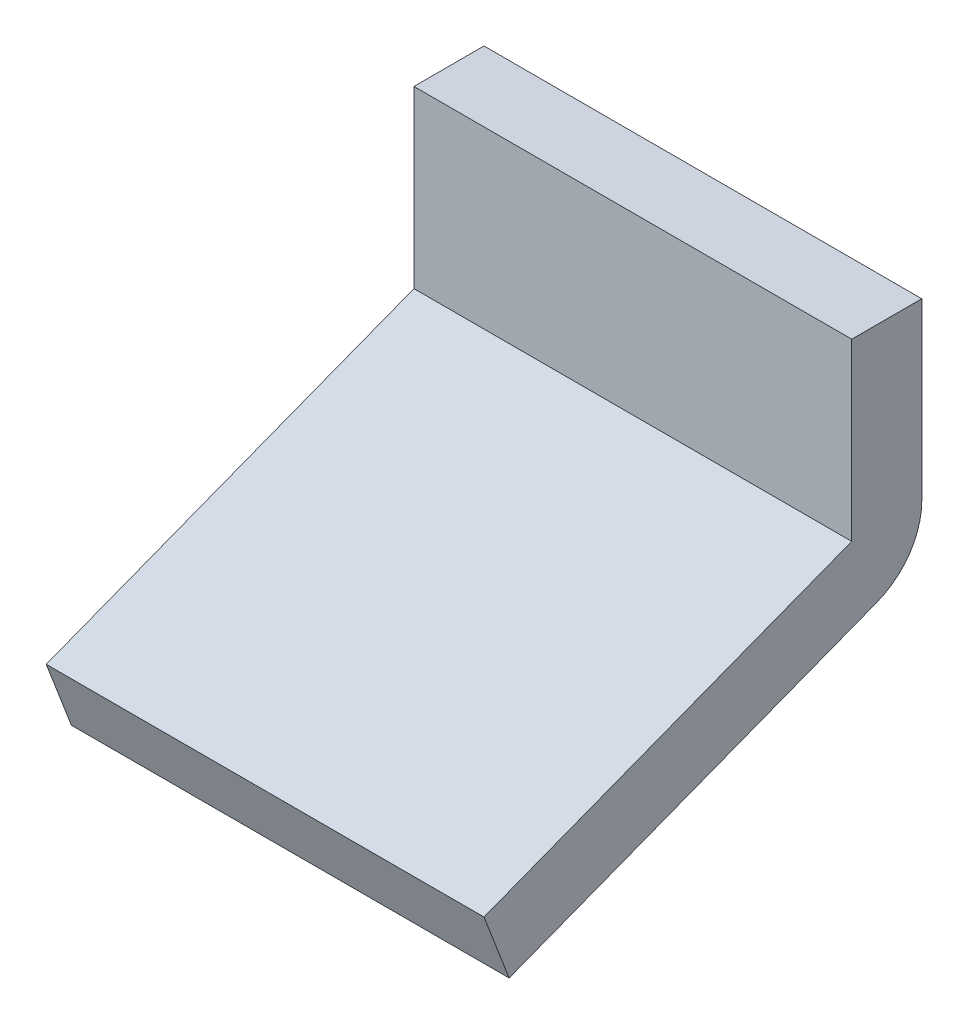
ISO-10303-21;
HEADER;
FILE_DESCRIPTION(('STEP AP214'),'2;1');
FILE_NAME('part.step','',(''),(''),'','','');
FILE_SCHEMA(('AUTOMOTIVE_DESIGN { 1 0 10303 214 1 1 1 1 }'));
ENDSEC;
DATA;
#1=APPLICATION_CONTEXT('core data for automotive mechanical design processes');
#2=APPLICATION_PROTOCOL_DEFINITION('international standard','automotive_design',2000,#1);
#3=PRODUCT_CONTEXT('',#1,'mechanical');
#4=PRODUCT('Part','Part','',(#3));
#5=PRODUCT_RELATED_PRODUCT_CATEGORY('part','',(#4));
#6=PRODUCT_DEFINITION_FORMATION('','',#4);
#7=PRODUCT_DEFINITION_CONTEXT('part definition',#1,'design');
#8=PRODUCT_DEFINITION('design','',#6,#7);
#9=PRODUCT_DEFINITION_SHAPE('','',#8);
#10=(LENGTH_UNIT() NAMED_UNIT(*) SI_UNIT(.MILLI.,.METRE.));
#11=(NAMED_UNIT(*) PLANE_ANGLE_UNIT() SI_UNIT($,.RADIAN.));
#12=(NAMED_UNIT(*) SI_UNIT($,.STERADIAN.) SOLID_ANGLE_UNIT());
#13=UNCERTAINTY_MEASURE_WITH_UNIT(LENGTH_MEASURE(1.E-05),#10,'distance_accuracy_value','');
#14=(GEOMETRIC_REPRESENTATION_CONTEXT(3) GLOBAL_UNCERTAINTY_ASSIGNED_CONTEXT((#13)) GLOBAL_UNIT_ASSIGNED_CONTEXT((#10,
#11,#12)) REPRESENTATION_CONTEXT('',''));
#15=CARTESIAN_POINT('',(0.,0.,0.));
#16=DIRECTION('',(0.,0.,1.));
#17=DIRECTION('',(1.,0.,0.));
#18=AXIS2_PLACEMENT_3D('',#15,#16,#17);
#19=CARTESIAN_POINT('',(-1.6,-2.25,0.0800000000000071));
#20=DIRECTION('',(0.,0.,-1.));
#21=DIRECTION('',(-1.,0.,0.));
#22=AXIS2_PLACEMENT_3D('',#19,#20,#21);
#23=PLANE('',#22);
#24=DIRECTION('',(0.,1.,0.));
#25=VECTOR('',#24,1.);
#26=CARTESIAN_POINT('',(1.1,-2.19208273518227,0.0800000000000071));
#27=LINE('',#26,#25);
#28=CARTESIAN_POINT('',(1.1,-2.25,0.0800000000000071));
#29=VERTEX_POINT('',#28);
#30=CARTESIAN_POINT('',(1.1,-2.45,0.0800000000000071));
#31=VERTEX_POINT('',#30);
#32=EDGE_CURVE('E123',#29,#31,#27,.F.);
#33=ORIENTED_EDGE('',*,*,#32,.T.);
#34=DIRECTION('',(1.,0.,0.));
#35=VECTOR('',#34,1.);
#36=CARTESIAN_POINT('',(1.6,-2.45,0.0800000000000071));
#37=LINE('',#36,#35);
#38=CARTESIAN_POINT('',(1.6,-2.45,0.0800000000000071));
#39=VERTEX_POINT('',#38);
#40=EDGE_CURVE('E108',#39,#31,#37,.F.);
#41=ORIENTED_EDGE('',*,*,#40,.F.);
#42=DIRECTION('',(0.,1.,0.));
#43=VECTOR('',#42,1.);
#44=CARTESIAN_POINT('',(1.6,-2.45,0.0800000000000071));
#45=LINE('',#44,#43);
#46=CARTESIAN_POINT('',(1.6,-2.25,0.0800000000000071));
#47=VERTEX_POINT('',#46);
#48=EDGE_CURVE('E131',#39,#47,#45,.T.);
#49=ORIENTED_EDGE('',*,*,#48,.T.);
#50=DIRECTION('',(1.,0.,0.));
#51=VECTOR('',#50,1.);
#52=CARTESIAN_POINT('',(-1.6,-2.25,0.0800000000000071));
#53=LINE('',#52,#51);
#54=EDGE_CURVE('E139',#47,#29,#53,.F.);
#55=ORIENTED_EDGE('',*,*,#54,.T.);
#56=EDGE_LOOP('',(#33,#41,#49,#55));
#57=FACE_BOUND('',#56,.T.);
#58=ADVANCED_FACE('F16',(#57),#23,.F.);
#59=CARTESIAN_POINT('',(-1.6,-2.25,0.));
#60=DIRECTION('',(0.,-1.,0.));
#61=DIRECTION('',(0.,0.,-1.));
#62=AXIS2_PLACEMENT_3D('',#59,#60,#61);
#63=PLANE('',#62);
#64=DIRECTION('',(0.,0.,-1.));
#65=VECTOR('',#64,1.);
#66=CARTESIAN_POINT('',(1.1,-2.25,0.0222781440158591));
#67=LINE('',#66,#65);
#68=CARTESIAN_POINT('',(1.1,-2.25,0.));
#69=VERTEX_POINT('',#68);
#70=EDGE_CURVE('E107',#69,#29,#67,.F.);
#71=ORIENTED_EDGE('',*,*,#70,.T.);
#72=ORIENTED_EDGE('',*,*,#54,.F.);
#73=DIRECTION('',(0.,0.,1.));
#74=VECTOR('',#73,1.);
#75=CARTESIAN_POINT('',(1.6,-2.25,0.0800000000000071));
#76=LINE('',#75,#74);
#77=CARTESIAN_POINT('',(1.6,-2.25,0.));
#78=VERTEX_POINT('',#77);
#79=EDGE_CURVE('E133',#47,#78,#76,.F.);
#80=ORIENTED_EDGE('',*,*,#79,.T.);
#81=DIRECTION('',(-1.,0.,0.));
#82=VECTOR('',#81,1.);
#83=CARTESIAN_POINT('',(-1.6,-2.25,0.));
#84=LINE('',#83,#82);
#85=EDGE_CURVE('E128',#69,#78,#84,.F.);
#86=ORIENTED_EDGE('',*,*,#85,.F.);
#87=EDGE_LOOP('',(#71,#72,#80,#86));
#88=FACE_BOUND('',#87,.T.);
#89=ADVANCED_FACE('F173',(#88),#63,.F.);
#90=CARTESIAN_POINT('',(-1.6,-2.25,0.));
#91=DIRECTION('',(0.,0.,-1.));
#92=DIRECTION('',(-1.,0.,0.));
#93=AXIS2_PLACEMENT_3D('',#90,#91,#92);
#94=PLANE('',#93);
#95=DIRECTION('',(0.,1.,0.));
#96=VECTOR('',#95,1.);
#97=CARTESIAN_POINT('',(1.6,-2.45,0.));
#98=LINE('',#97,#96);
#99=CARTESIAN_POINT('',(1.6,-2.45,0.));
#100=VERTEX_POINT('',#99);
#101=EDGE_CURVE('E143',#78,#100,#98,.F.);
#102=ORIENTED_EDGE('',*,*,#101,.T.);
#103=DIRECTION('',(1.,0.,0.));
#104=VECTOR('',#103,1.);
#105=CARTESIAN_POINT('',(1.6,-2.45,0.));
#106=LINE('',#105,#104);
#107=CARTESIAN_POINT('',(1.1,-2.45,0.));
#108=VERTEX_POINT('',#107);
#109=EDGE_CURVE('E85',#108,#100,#106,.T.);
#110=ORIENTED_EDGE('',*,*,#109,.F.);
#111=DIRECTION('',(0.,1.,0.));
#112=VECTOR('',#111,1.);
#113=CARTESIAN_POINT('',(1.1,-2.19208273518227,0.));
#114=LINE('',#113,#112);
#115=EDGE_CURVE('E81',#108,#69,#114,.T.);
#116=ORIENTED_EDGE('',*,*,#115,.T.);
#117=ORIENTED_EDGE('',*,*,#85,.T.);
#118=EDGE_LOOP('',(#102,#110,#116,#117));
#119=FACE_BOUND('',#118,.T.);
#120=ADVANCED_FACE('F174',(#119),#94,.T.);
#121=CARTESIAN_POINT('',(1.6,-2.45,0.0800000000000071));
#122=DIRECTION('',(0.,0.933333333333333,0.359010987142301));
#123=DIRECTION('',(0.,-0.359010987142301,0.933333333333333));
#124=AXIS2_PLACEMENT_3D('',#121,#122,#123);
#125=PLANE('',#124);
#126=DIRECTION('',(0.,0.35901098714229,-0.933333333333337));
#127=VECTOR('',#126,1.);
#128=CARTESIAN_POINT('',(1.6,-2.61155494421403,0.500000000000007));
#129=LINE('',#128,#127);
#130=CARTESIAN_POINT('',(1.6,-2.61155494421403,0.500000000000007));
#131=VERTEX_POINT('',#130);
#132=EDGE_CURVE('E113',#131,#39,#129,.T.);
#133=ORIENTED_EDGE('',*,*,#132,.T.);
#134=ORIENTED_EDGE('',*,*,#40,.T.);
#135=DIRECTION('',(0.,-0.35901098714229,0.933333333333337));
#136=VECTOR('',#135,1.);
#137=CARTESIAN_POINT('',(1.1,-2.45,0.0800000000000071));
#138=LINE('',#137,#136);
#139=CARTESIAN_POINT('',(1.1,-2.61155494421403,0.500000000000007));
#140=VERTEX_POINT('',#139);
#141=EDGE_CURVE('E86',#31,#140,#138,.T.);
#142=ORIENTED_EDGE('',*,*,#141,.T.);
#143=DIRECTION('',(1.,0.,0.));
#144=VECTOR('',#143,1.);
#145=CARTESIAN_POINT('',(1.6,-2.61155494421403,0.500000000000007));
#146=LINE('',#145,#144);
#147=EDGE_CURVE('E96',#131,#140,#146,.F.);
#148=ORIENTED_EDGE('',*,*,#147,.F.);
#149=EDGE_LOOP('',(#133,#134,#142,#148));
#150=FACE_BOUND('',#149,.T.);
#151=ADVANCED_FACE('F178',(#150),#125,.T.);
#152=CARTESIAN_POINT('',(1.1,-2.19208273518227,0.0222781440158591));
#153=DIRECTION('',(1.,0.,0.));
#154=DIRECTION('',(0.,0.,-1.));
#155=AXIS2_PLACEMENT_3D('',#152,#153,#154);
#156=PLANE('',#155);
#157=ORIENTED_EDGE('',*,*,#32,.F.);
#158=ORIENTED_EDGE('',*,*,#70,.F.);
#159=ORIENTED_EDGE('',*,*,#115,.F.);
#160=CARTESIAN_POINT('',(1.1,-2.45,0.0800000000000071));
#161=DIRECTION('',(1.,0.,0.));
#162=DIRECTION('',(0.,0.,-1.));
#163=AXIS2_PLACEMENT_3D('',#160,#161,#162);
#164=CIRCLE('',#163,0.0800000000000036);
#165=CARTESIAN_POINT('',(1.1,-2.52466666666667,0.0512791210286231));
#166=VERTEX_POINT('',#165);
#167=EDGE_CURVE('E19',#166,#108,#164,.T.);
#168=ORIENTED_EDGE('',*,*,#167,.F.);
#169=DIRECTION('',(0.,0.359010987142294,-0.933333333333336));
#170=VECTOR('',#169,1.);
#171=CARTESIAN_POINT('',(1.1,-2.6862216108807,0.471279121028623));
#172=LINE('',#171,#170);
#173=CARTESIAN_POINT('',(1.1,-2.6862216108807,0.471279121028622));
#174=VERTEX_POINT('',#173);
#175=EDGE_CURVE('E77',#174,#166,#172,.T.);
#176=ORIENTED_EDGE('',*,*,#175,.F.);
#177=DIRECTION('',(0.,-0.933333333333333,-0.359010987142301));
#178=VECTOR('',#177,1.);
#179=CARTESIAN_POINT('',(1.1,-2.61155494421403,0.500000000000007));
#180=LINE('',#179,#178);
#181=EDGE_CURVE('E111',#140,#174,#180,.T.);
#182=ORIENTED_EDGE('',*,*,#181,.F.);
#183=ORIENTED_EDGE('',*,*,#141,.F.);
#184=EDGE_LOOP('',(#157,#158,#159,#168,#176,#182,#183));
#185=FACE_BOUND('',#184,.T.);
#186=ADVANCED_FACE('F74',(#185),#156,.F.);
#187=CARTESIAN_POINT('',(1.6,-2.45,0.0800000000000071));
#188=DIRECTION('',(1.,0.,0.));
#189=DIRECTION('',(0.,0.,-1.));
#190=AXIS2_PLACEMENT_3D('',#187,#188,#189);
#191=CYLINDRICAL_SURFACE('',#190,0.0800000000000036);
#192=CARTESIAN_POINT('',(1.6,-2.45,0.0800000000000071));
#193=DIRECTION('',(1.,0.,0.));
#194=DIRECTION('',(0.,0.,-1.));
#195=AXIS2_PLACEMENT_3D('',#192,#193,#194);
#196=CIRCLE('',#195,0.0800000000000036);
#197=CARTESIAN_POINT('',(1.6,-2.52466666666667,0.0512791210286231));
#198=VERTEX_POINT('',#197);
#199=EDGE_CURVE('E91',#100,#198,#196,.F.);
#200=ORIENTED_EDGE('',*,*,#199,.T.);
#201=DIRECTION('',(1.,0.,0.));
#202=VECTOR('',#201,1.);
#203=CARTESIAN_POINT('',(1.6,-2.52466666666667,0.051279121028623));
#204=LINE('',#203,#202);
#205=EDGE_CURVE('E88',#166,#198,#204,.T.);
#206=ORIENTED_EDGE('',*,*,#205,.F.);
#207=ORIENTED_EDGE('',*,*,#167,.T.);
#208=ORIENTED_EDGE('',*,*,#109,.T.);
#209=EDGE_LOOP('',(#200,#206,#207,#208));
#210=FACE_BOUND('',#209,.T.);
#211=ADVANCED_FACE('F89',(#210),#191,.T.);
#212=CARTESIAN_POINT('',(1.6,-2.45,0.0800000000000071));
#213=DIRECTION('',(-1.,0.,0.));
#214=DIRECTION('',(0.,0.,1.));
#215=AXIS2_PLACEMENT_3D('',#212,#213,#214);
#216=PLANE('',#215);
#217=DIRECTION('',(0.,-0.933333333333333,-0.359010987142301));
#218=VECTOR('',#217,1.);
#219=CARTESIAN_POINT('',(1.6,-2.61155494421403,0.500000000000007));
#220=LINE('',#219,#218);
#221=CARTESIAN_POINT('',(1.6,-2.6862216108807,0.471279121028622));
#222=VERTEX_POINT('',#221);
#223=EDGE_CURVE('E34',#222,#131,#220,.F.);
#224=ORIENTED_EDGE('',*,*,#223,.F.);
#225=DIRECTION('',(0.,0.359010987142294,-0.933333333333336));
#226=VECTOR('',#225,1.);
#227=CARTESIAN_POINT('',(1.6,-2.6862216108807,0.471279121028623));
#228=LINE('',#227,#226);
#229=EDGE_CURVE('E25',#198,#222,#228,.F.);
#230=ORIENTED_EDGE('',*,*,#229,.F.);
#231=ORIENTED_EDGE('',*,*,#199,.F.);
#232=ORIENTED_EDGE('',*,*,#101,.F.);
#233=ORIENTED_EDGE('',*,*,#79,.F.);
#234=ORIENTED_EDGE('',*,*,#48,.F.);
#235=ORIENTED_EDGE('',*,*,#132,.F.);
#236=EDGE_LOOP('',(#224,#230,#231,#232,#233,#234,#235));
#237=FACE_BOUND('',#236,.T.);
#238=ADVANCED_FACE('F168',(#237),#216,.F.);
#239=CARTESIAN_POINT('',(1.6,-2.61155494421403,0.500000000000007));
#240=DIRECTION('',(0.,-0.359010987142301,0.933333333333333));
#241=DIRECTION('',(0.,-0.933333333333333,-0.359010987142301));
#242=AXIS2_PLACEMENT_3D('',#239,#240,#241);
#243=PLANE('',#242);
#244=ORIENTED_EDGE('',*,*,#223,.T.);
#245=ORIENTED_EDGE('',*,*,#147,.T.);
#246=ORIENTED_EDGE('',*,*,#181,.T.);
#247=DIRECTION('',(1.,0.,0.));
#248=VECTOR('',#247,1.);
#249=CARTESIAN_POINT('',(1.6,-2.6862216108807,0.471279121028623));
#250=LINE('',#249,#248);
#251=EDGE_CURVE('E11',#222,#174,#250,.F.);
#252=ORIENTED_EDGE('',*,*,#251,.F.);
#253=EDGE_LOOP('',(#244,#245,#246,#252));
#254=FACE_BOUND('',#253,.T.);
#255=ADVANCED_FACE('F166',(#254),#243,.T.);
#256=CARTESIAN_POINT('',(1.6,-2.6862216108807,0.471279121028623));
#257=DIRECTION('',(0.,-0.933333333333336,-0.359010987142294));
#258=DIRECTION('',(0.,0.359010987142294,-0.933333333333336));
#259=AXIS2_PLACEMENT_3D('',#256,#257,#258);
#260=PLANE('',#259);
#261=ORIENTED_EDGE('',*,*,#229,.T.);
#262=ORIENTED_EDGE('',*,*,#251,.T.);
#263=ORIENTED_EDGE('',*,*,#175,.T.);
#264=ORIENTED_EDGE('',*,*,#205,.T.);
#265=EDGE_LOOP('',(#261,#262,#263,#264));
#266=FACE_BOUND('',#265,.T.);
#267=ADVANCED_FACE('F95',(#266),#260,.T.);
#268=CLOSED_SHELL('',(#58,#89,#120,#151,#186,#211,#238,#255,#267));
#269=MANIFOLD_SOLID_BREP('B1',#268);
#270=ADVANCED_BREP_SHAPE_REPRESENTATION('',(#18,#269),#14);
#271=SHAPE_DEFINITION_REPRESENTATION(#9,#270);
ENDSEC;
END-ISO-10303-21;
